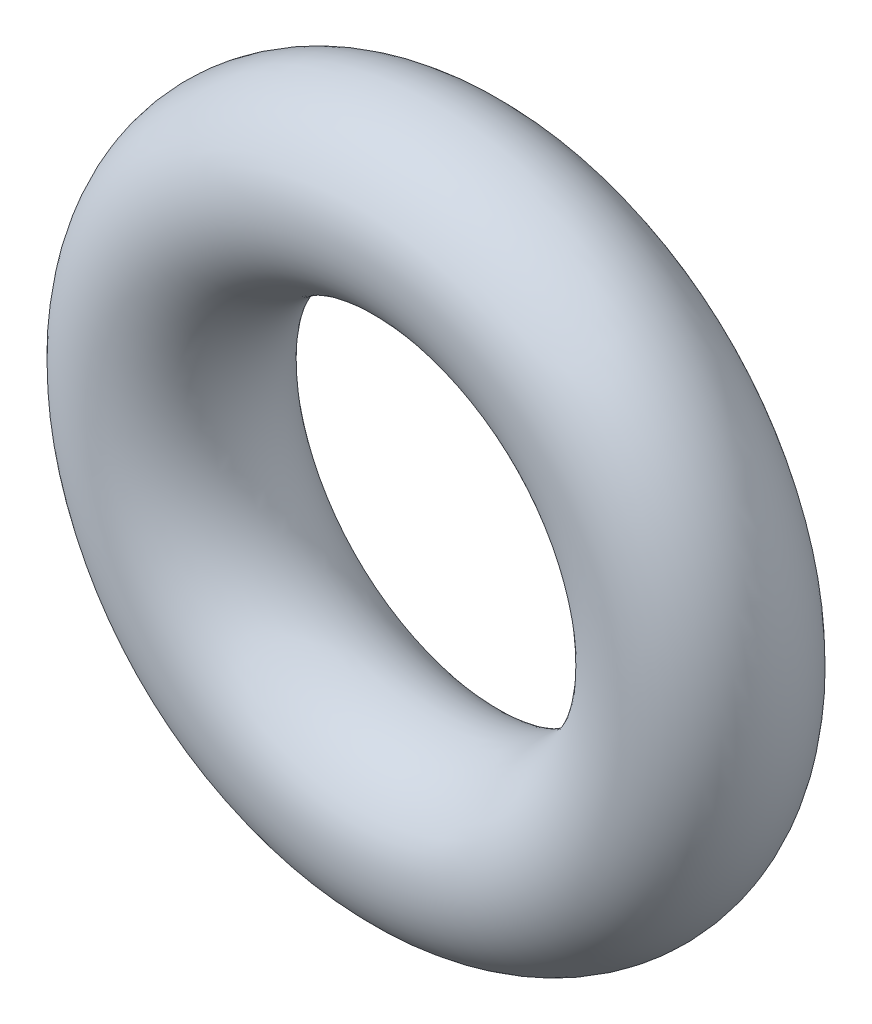
ISO-10303-21;
HEADER;
FILE_DESCRIPTION(('STEP AP214'),'2;1');
FILE_NAME('part.step','',(''),(''),'','','');
FILE_SCHEMA(('AUTOMOTIVE_DESIGN { 1 0 10303 214 1 1 1 1 }'));
ENDSEC;
DATA;
#1=APPLICATION_CONTEXT('core data for automotive mechanical design processes');
#2=APPLICATION_PROTOCOL_DEFINITION('international standard','automotive_design',2000,#1);
#3=PRODUCT_CONTEXT('',#1,'mechanical');
#4=PRODUCT('Part','Part','',(#3));
#5=PRODUCT_RELATED_PRODUCT_CATEGORY('part','',(#4));
#6=PRODUCT_DEFINITION_FORMATION('','',#4);
#7=PRODUCT_DEFINITION_CONTEXT('part definition',#1,'design');
#8=PRODUCT_DEFINITION('design','',#6,#7);
#9=PRODUCT_DEFINITION_SHAPE('','',#8);
#10=(LENGTH_UNIT() NAMED_UNIT(*) SI_UNIT(.MILLI.,.METRE.));
#11=(NAMED_UNIT(*) PLANE_ANGLE_UNIT() SI_UNIT($,.RADIAN.));
#12=(NAMED_UNIT(*) SI_UNIT($,.STERADIAN.) SOLID_ANGLE_UNIT());
#13=UNCERTAINTY_MEASURE_WITH_UNIT(LENGTH_MEASURE(1.E-05),#10,'distance_accuracy_value','');
#14=(GEOMETRIC_REPRESENTATION_CONTEXT(3) GLOBAL_UNCERTAINTY_ASSIGNED_CONTEXT((#13)) GLOBAL_UNIT_ASSIGNED_CONTEXT((#10,
#11,#12)) REPRESENTATION_CONTEXT('',''));
#15=CARTESIAN_POINT('',(0.,0.,0.));
#16=DIRECTION('',(0.,0.,1.));
#17=DIRECTION('',(1.,0.,0.));
#18=AXIS2_PLACEMENT_3D('',#15,#16,#17);
#19=CARTESIAN_POINT('',(0.,0.,0.));
#20=DIRECTION('',(0.,0.,1.));
#21=DIRECTION('',(1.,0.,0.));
#22=AXIS2_PLACEMENT_3D('',#19,#20,#21);
#23=TOROIDAL_SURFACE('',#22,3.9243,1.3081);
#24=CARTESIAN_POINT('',(5.2324,0.,0.));
#25=VERTEX_POINT('',#24);
#26=VERTEX_LOOP('',#25);
#27=FACE_BOUND('',#26,.T.);
#28=ADVANCED_FACE('F28',(#27),#23,.T.);
#29=CLOSED_SHELL('',(#28));
#30=MANIFOLD_SOLID_BREP('B2',#29);
#31=ADVANCED_BREP_SHAPE_REPRESENTATION('',(#18,#30),#14);
#32=SHAPE_DEFINITION_REPRESENTATION(#9,#31);
ENDSEC;
END-ISO-10303-21;
